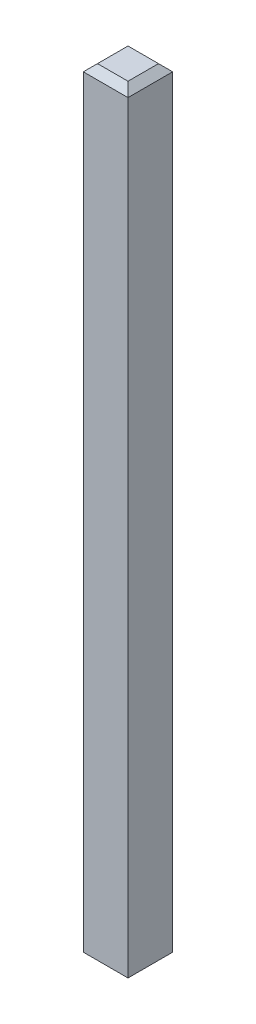
ISO-10303-21;
HEADER;
FILE_DESCRIPTION(('STEP AP214'),'2;1');
FILE_NAME('part.step','',(''),(''),'','','');
FILE_SCHEMA(('AUTOMOTIVE_DESIGN { 1 0 10303 214 1 1 1 1 }'));
ENDSEC;
DATA;
#1=APPLICATION_CONTEXT('core data for automotive mechanical design processes');
#2=APPLICATION_PROTOCOL_DEFINITION('international standard','automotive_design',2000,#1);
#3=PRODUCT_CONTEXT('',#1,'mechanical');
#4=PRODUCT('Part','Part','',(#3));
#5=PRODUCT_RELATED_PRODUCT_CATEGORY('part','',(#4));
#6=PRODUCT_DEFINITION_FORMATION('','',#4);
#7=PRODUCT_DEFINITION_CONTEXT('part definition',#1,'design');
#8=PRODUCT_DEFINITION('design','',#6,#7);
#9=PRODUCT_DEFINITION_SHAPE('','',#8);
#10=(LENGTH_UNIT() NAMED_UNIT(*) SI_UNIT(.MILLI.,.METRE.));
#11=(NAMED_UNIT(*) PLANE_ANGLE_UNIT() SI_UNIT($,.RADIAN.));
#12=(NAMED_UNIT(*) SI_UNIT($,.STERADIAN.) SOLID_ANGLE_UNIT());
#13=UNCERTAINTY_MEASURE_WITH_UNIT(LENGTH_MEASURE(1.E-05),#10,'distance_accuracy_value','');
#14=(GEOMETRIC_REPRESENTATION_CONTEXT(3) GLOBAL_UNCERTAINTY_ASSIGNED_CONTEXT((#13)) GLOBAL_UNIT_ASSIGNED_CONTEXT((#10,
#11,#12)) REPRESENTATION_CONTEXT('',''));
#15=CARTESIAN_POINT('',(0.,0.,0.));
#16=DIRECTION('',(0.,0.,1.));
#17=DIRECTION('',(1.,0.,0.));
#18=AXIS2_PLACEMENT_3D('',#15,#16,#17);
#19=CARTESIAN_POINT('',(0.315,10.95,-0.315));
#20=DIRECTION('',(-1.,0.,0.));
#21=DIRECTION('',(0.,0.,1.));
#22=AXIS2_PLACEMENT_3D('',#19,#20,#21);
#23=PLANE('',#22);
#24=DIRECTION('',(0.,-1.,0.));
#25=VECTOR('',#24,1.);
#26=CARTESIAN_POINT('',(0.315,10.95,0.315));
#27=LINE('',#26,#25);
#28=CARTESIAN_POINT('',(0.315,10.85,0.315));
#29=VERTEX_POINT('',#28);
#30=CARTESIAN_POINT('',(0.315,0.100000000000001,0.315));
#31=VERTEX_POINT('',#30);
#32=EDGE_CURVE('E151',#29,#31,#27,.T.);
#33=ORIENTED_EDGE('',*,*,#32,.T.);
#34=DIRECTION('',(0.,0.,-1.));
#35=VECTOR('',#34,1.);
#36=CARTESIAN_POINT('',(0.315,0.100000000000001,-0.315));
#37=LINE('',#36,#35);
#38=CARTESIAN_POINT('',(0.315,0.100000000000001,-0.315));
#39=VERTEX_POINT('',#38);
#40=EDGE_CURVE('E160',#31,#39,#37,.T.);
#41=ORIENTED_EDGE('',*,*,#40,.T.);
#42=DIRECTION('',(0.,-1.,0.));
#43=VECTOR('',#42,1.);
#44=CARTESIAN_POINT('',(0.315,10.95,-0.315));
#45=LINE('',#44,#43);
#46=CARTESIAN_POINT('',(0.315,10.85,-0.315));
#47=VERTEX_POINT('',#46);
#48=EDGE_CURVE('E129',#47,#39,#45,.T.);
#49=ORIENTED_EDGE('',*,*,#48,.F.);
#50=DIRECTION('',(0.,0.,1.));
#51=VECTOR('',#50,1.);
#52=CARTESIAN_POINT('',(0.315,10.85,0.315));
#53=LINE('',#52,#51);
#54=EDGE_CURVE('E162',#47,#29,#53,.T.);
#55=ORIENTED_EDGE('',*,*,#54,.T.);
#56=EDGE_LOOP('',(#33,#41,#49,#55));
#57=FACE_BOUND('',#56,.T.);
#58=ADVANCED_FACE('F41',(#57),#23,.F.);
#59=CARTESIAN_POINT('',(-0.315,10.95,-0.315));
#60=DIRECTION('',(0.,0.,1.));
#61=DIRECTION('',(1.,0.,0.));
#62=AXIS2_PLACEMENT_3D('',#59,#60,#61);
#63=PLANE('',#62);
#64=ORIENTED_EDGE('',*,*,#48,.T.);
#65=DIRECTION('',(-1.,0.,0.));
#66=VECTOR('',#65,1.);
#67=CARTESIAN_POINT('',(-0.315,0.100000000000001,-0.315));
#68=LINE('',#67,#66);
#69=CARTESIAN_POINT('',(-0.315,0.100000000000001,-0.315));
#70=VERTEX_POINT('',#69);
#71=EDGE_CURVE('E128',#39,#70,#68,.T.);
#72=ORIENTED_EDGE('',*,*,#71,.T.);
#73=DIRECTION('',(0.,-1.,0.));
#74=VECTOR('',#73,1.);
#75=CARTESIAN_POINT('',(-0.315,10.95,-0.315));
#76=LINE('',#75,#74);
#77=CARTESIAN_POINT('',(-0.315,10.85,-0.315));
#78=VERTEX_POINT('',#77);
#79=EDGE_CURVE('E111',#78,#70,#76,.T.);
#80=ORIENTED_EDGE('',*,*,#79,.F.);
#81=DIRECTION('',(1.,0.,0.));
#82=VECTOR('',#81,1.);
#83=CARTESIAN_POINT('',(0.315,10.85,-0.315));
#84=LINE('',#83,#82);
#85=EDGE_CURVE('E125',#78,#47,#84,.T.);
#86=ORIENTED_EDGE('',*,*,#85,.T.);
#87=EDGE_LOOP('',(#64,#72,#80,#86));
#88=FACE_BOUND('',#87,.T.);
#89=ADVANCED_FACE('F124',(#88),#63,.F.);
#90=CARTESIAN_POINT('',(-0.315,10.95,-0.315));
#91=DIRECTION('',(1.,0.,0.));
#92=DIRECTION('',(0.,0.,-1.));
#93=AXIS2_PLACEMENT_3D('',#90,#91,#92);
#94=PLANE('',#93);
#95=ORIENTED_EDGE('',*,*,#79,.T.);
#96=DIRECTION('',(0.,0.,1.));
#97=VECTOR('',#96,1.);
#98=CARTESIAN_POINT('',(-0.315,0.100000000000001,-0.315));
#99=LINE('',#98,#97);
#100=CARTESIAN_POINT('',(-0.315,0.100000000000001,0.315));
#101=VERTEX_POINT('',#100);
#102=EDGE_CURVE('E117',#70,#101,#99,.T.);
#103=ORIENTED_EDGE('',*,*,#102,.T.);
#104=DIRECTION('',(0.,-1.,0.));
#105=VECTOR('',#104,1.);
#106=CARTESIAN_POINT('',(-0.315,10.95,0.315));
#107=LINE('',#106,#105);
#108=CARTESIAN_POINT('',(-0.315,10.85,0.315));
#109=VERTEX_POINT('',#108);
#110=EDGE_CURVE('E113',#109,#101,#107,.T.);
#111=ORIENTED_EDGE('',*,*,#110,.F.);
#112=DIRECTION('',(0.,0.,-1.));
#113=VECTOR('',#112,1.);
#114=CARTESIAN_POINT('',(-0.315,10.85,-0.315));
#115=LINE('',#114,#113);
#116=EDGE_CURVE('E108',#109,#78,#115,.T.);
#117=ORIENTED_EDGE('',*,*,#116,.T.);
#118=EDGE_LOOP('',(#95,#103,#111,#117));
#119=FACE_BOUND('',#118,.T.);
#120=ADVANCED_FACE('F110',(#119),#94,.F.);
#121=CARTESIAN_POINT('',(-0.315,10.95,0.315));
#122=DIRECTION('',(0.,0.,-1.));
#123=DIRECTION('',(-1.,0.,0.));
#124=AXIS2_PLACEMENT_3D('',#121,#122,#123);
#125=PLANE('',#124);
#126=ORIENTED_EDGE('',*,*,#110,.T.);
#127=DIRECTION('',(1.,0.,0.));
#128=VECTOR('',#127,1.);
#129=CARTESIAN_POINT('',(-0.315,0.100000000000001,0.315));
#130=LINE('',#129,#128);
#131=EDGE_CURVE('E164',#101,#31,#130,.T.);
#132=ORIENTED_EDGE('',*,*,#131,.T.);
#133=ORIENTED_EDGE('',*,*,#32,.F.);
#134=DIRECTION('',(-1.,0.,0.));
#135=VECTOR('',#134,1.);
#136=CARTESIAN_POINT('',(-0.315,10.85,0.315));
#137=LINE('',#136,#135);
#138=EDGE_CURVE('E166',#29,#109,#137,.T.);
#139=ORIENTED_EDGE('',*,*,#138,.T.);
#140=EDGE_LOOP('',(#126,#132,#133,#139));
#141=FACE_BOUND('',#140,.T.);
#142=ADVANCED_FACE('F204',(#141),#125,.F.);
#143=CARTESIAN_POINT('',(0.,10.95,0.));
#144=DIRECTION('',(0.,1.,0.));
#145=DIRECTION('',(0.,0.,1.));
#146=AXIS2_PLACEMENT_3D('',#143,#144,#145);
#147=PLANE('',#146);
#148=DIRECTION('',(0.,0.,1.));
#149=VECTOR('',#148,1.);
#150=CARTESIAN_POINT('',(-0.215,10.95,0.315));
#151=LINE('',#150,#149);
#152=CARTESIAN_POINT('',(-0.215,10.95,-0.215));
#153=VERTEX_POINT('',#152);
#154=CARTESIAN_POINT('',(-0.215,10.95,0.215));
#155=VERTEX_POINT('',#154);
#156=EDGE_CURVE('E51',#153,#155,#151,.T.);
#157=ORIENTED_EDGE('',*,*,#156,.T.);
#158=DIRECTION('',(1.,0.,0.));
#159=VECTOR('',#158,1.);
#160=CARTESIAN_POINT('',(0.315,10.95,0.215));
#161=LINE('',#160,#159);
#162=CARTESIAN_POINT('',(0.215,10.95,0.215));
#163=VERTEX_POINT('',#162);
#164=EDGE_CURVE('E11',#155,#163,#161,.T.);
#165=ORIENTED_EDGE('',*,*,#164,.T.);
#166=DIRECTION('',(0.,0.,-1.));
#167=VECTOR('',#166,1.);
#168=CARTESIAN_POINT('',(0.215,10.95,-0.315));
#169=LINE('',#168,#167);
#170=CARTESIAN_POINT('',(0.215,10.95,-0.215));
#171=VERTEX_POINT('',#170);
#172=EDGE_CURVE('E158',#163,#171,#169,.T.);
#173=ORIENTED_EDGE('',*,*,#172,.T.);
#174=DIRECTION('',(-1.,0.,0.));
#175=VECTOR('',#174,1.);
#176=CARTESIAN_POINT('',(-0.315,10.95,-0.215));
#177=LINE('',#176,#175);
#178=EDGE_CURVE('E62',#171,#153,#177,.T.);
#179=ORIENTED_EDGE('',*,*,#178,.T.);
#180=EDGE_LOOP('',(#157,#165,#173,#179));
#181=FACE_BOUND('',#180,.T.);
#182=ADVANCED_FACE('F210',(#181),#147,.T.);
#183=CARTESIAN_POINT('',(0.,0.,0.));
#184=DIRECTION('',(0.,1.,0.));
#185=DIRECTION('',(0.,0.,1.));
#186=AXIS2_PLACEMENT_3D('',#183,#184,#185);
#187=PLANE('',#186);
#188=DIRECTION('',(0.,0.,-1.));
#189=VECTOR('',#188,1.);
#190=CARTESIAN_POINT('',(-0.215000000000001,0.,0.));
#191=LINE('',#190,#189);
#192=CARTESIAN_POINT('',(-0.215,0.,0.215000000000001));
#193=VERTEX_POINT('',#192);
#194=CARTESIAN_POINT('',(-0.215000000000001,0.,-0.215000000000001));
#195=VERTEX_POINT('',#194);
#196=EDGE_CURVE('E171',#193,#195,#191,.T.);
#197=ORIENTED_EDGE('',*,*,#196,.T.);
#198=DIRECTION('',(1.,0.,0.));
#199=VECTOR('',#198,1.);
#200=CARTESIAN_POINT('',(0.,0.,-0.215000000000001));
#201=LINE('',#200,#199);
#202=CARTESIAN_POINT('',(0.215000000000001,0.,-0.215000000000001));
#203=VERTEX_POINT('',#202);
#204=EDGE_CURVE('E118',#195,#203,#201,.T.);
#205=ORIENTED_EDGE('',*,*,#204,.T.);
#206=DIRECTION('',(0.,0.,1.));
#207=VECTOR('',#206,1.);
#208=CARTESIAN_POINT('',(0.215000000000001,0.,0.));
#209=LINE('',#208,#207);
#210=CARTESIAN_POINT('',(0.215000000000001,0.,0.215000000000001));
#211=VERTEX_POINT('',#210);
#212=EDGE_CURVE('E175',#203,#211,#209,.T.);
#213=ORIENTED_EDGE('',*,*,#212,.T.);
#214=DIRECTION('',(-1.,0.,0.));
#215=VECTOR('',#214,1.);
#216=CARTESIAN_POINT('',(0.,0.,0.215000000000001));
#217=LINE('',#216,#215);
#218=EDGE_CURVE('E173',#211,#193,#217,.T.);
#219=ORIENTED_EDGE('',*,*,#218,.T.);
#220=EDGE_LOOP('',(#197,#205,#213,#219));
#221=FACE_BOUND('',#220,.T.);
#222=ADVANCED_FACE('F212',(#221),#187,.F.);
#223=CARTESIAN_POINT('',(-0.315,0.100000000000001,0.315));
#224=DIRECTION('',(0.,0.707106781186541,-0.707106781186554));
#225=DIRECTION('',(1.,0.,0.));
#226=AXIS2_PLACEMENT_3D('',#223,#224,#225);
#227=PLANE('',#226);
#228=DIRECTION('',(0.577350269189622,-0.577350269189632,-0.577350269189622));
#229=VECTOR('',#228,1.);
#230=CARTESIAN_POINT('',(-0.315,0.100000000000001,0.315));
#231=LINE('',#230,#229);
#232=EDGE_CURVE('E152',#193,#101,#231,.F.);
#233=ORIENTED_EDGE('',*,*,#232,.F.);
#234=ORIENTED_EDGE('',*,*,#218,.F.);
#235=DIRECTION('',(-0.577350269189622,-0.577350269189632,-0.577350269189622));
#236=VECTOR('',#235,1.);
#237=CARTESIAN_POINT('',(0.105000000000003,-0.11,0.105000000000002));
#238=LINE('',#237,#236);
#239=EDGE_CURVE('E148',#31,#211,#238,.T.);
#240=ORIENTED_EDGE('',*,*,#239,.F.);
#241=ORIENTED_EDGE('',*,*,#131,.F.);
#242=EDGE_LOOP('',(#233,#234,#240,#241));
#243=FACE_BOUND('',#242,.T.);
#244=ADVANCED_FACE('F191',(#243),#227,.F.);
#245=CARTESIAN_POINT('',(0.315,0.100000000000001,-0.315));
#246=DIRECTION('',(-0.707106781186554,0.707106781186541,0.));
#247=DIRECTION('',(0.,0.,-1.));
#248=AXIS2_PLACEMENT_3D('',#245,#246,#247);
#249=PLANE('',#248);
#250=ORIENTED_EDGE('',*,*,#239,.T.);
#251=ORIENTED_EDGE('',*,*,#212,.F.);
#252=DIRECTION('',(0.577350269189622,0.577350269189632,-0.577350269189622));
#253=VECTOR('',#252,1.);
#254=CARTESIAN_POINT('',(0.315,0.100000000000001,-0.315));
#255=LINE('',#254,#253);
#256=EDGE_CURVE('E139',#39,#203,#255,.F.);
#257=ORIENTED_EDGE('',*,*,#256,.F.);
#258=ORIENTED_EDGE('',*,*,#40,.F.);
#259=EDGE_LOOP('',(#250,#251,#257,#258));
#260=FACE_BOUND('',#259,.T.);
#261=ADVANCED_FACE('F195',(#260),#249,.F.);
#262=CARTESIAN_POINT('',(-0.315,0.100000000000001,-0.315));
#263=DIRECTION('',(0.707106781186554,0.707106781186541,0.));
#264=DIRECTION('',(0.,0.,1.));
#265=AXIS2_PLACEMENT_3D('',#262,#263,#264);
#266=PLANE('',#265);
#267=ORIENTED_EDGE('',*,*,#232,.T.);
#268=ORIENTED_EDGE('',*,*,#102,.F.);
#269=DIRECTION('',(0.577350269189622,-0.577350269189632,0.577350269189622));
#270=VECTOR('',#269,1.);
#271=CARTESIAN_POINT('',(-0.315,0.100000000000001,-0.315));
#272=LINE('',#271,#270);
#273=EDGE_CURVE('E138',#195,#70,#272,.F.);
#274=ORIENTED_EDGE('',*,*,#273,.F.);
#275=ORIENTED_EDGE('',*,*,#196,.F.);
#276=EDGE_LOOP('',(#267,#268,#274,#275));
#277=FACE_BOUND('',#276,.T.);
#278=ADVANCED_FACE('F203',(#277),#266,.F.);
#279=CARTESIAN_POINT('',(-0.315,0.100000000000001,-0.315));
#280=DIRECTION('',(0.,0.707106781186541,0.707106781186554));
#281=DIRECTION('',(-1.,0.,0.));
#282=AXIS2_PLACEMENT_3D('',#279,#280,#281);
#283=PLANE('',#282);
#284=ORIENTED_EDGE('',*,*,#256,.T.);
#285=ORIENTED_EDGE('',*,*,#204,.F.);
#286=ORIENTED_EDGE('',*,*,#273,.T.);
#287=ORIENTED_EDGE('',*,*,#71,.F.);
#288=EDGE_LOOP('',(#284,#285,#286,#287));
#289=FACE_BOUND('',#288,.T.);
#290=ADVANCED_FACE('F198',(#289),#283,.F.);
#291=CARTESIAN_POINT('',(0.,10.95,-0.215));
#292=DIRECTION('',(0.,0.707106781186544,-0.707106781186551));
#293=DIRECTION('',(1.,0.,0.));
#294=AXIS2_PLACEMENT_3D('',#291,#292,#293);
#295=PLANE('',#294);
#296=DIRECTION('',(-0.577350269189624,0.577350269189629,0.577350269189624));
#297=VECTOR('',#296,1.);
#298=CARTESIAN_POINT('',(0.143333333333334,11.0216666666667,-0.143333333333334));
#299=LINE('',#298,#297);
#300=EDGE_CURVE('E134',#47,#171,#299,.T.);
#301=ORIENTED_EDGE('',*,*,#300,.F.);
#302=ORIENTED_EDGE('',*,*,#85,.F.);
#303=DIRECTION('',(0.577350269189624,0.577350269189629,0.577350269189624));
#304=VECTOR('',#303,1.);
#305=CARTESIAN_POINT('',(-0.143333333333334,11.0216666666667,-0.143333333333334));
#306=LINE('',#305,#304);
#307=EDGE_CURVE('E46',#153,#78,#306,.F.);
#308=ORIENTED_EDGE('',*,*,#307,.F.);
#309=ORIENTED_EDGE('',*,*,#178,.F.);
#310=EDGE_LOOP('',(#301,#302,#308,#309));
#311=FACE_BOUND('',#310,.T.);
#312=ADVANCED_FACE('F44',(#311),#295,.T.);
#313=CARTESIAN_POINT('',(-0.215,10.95,0.));
#314=DIRECTION('',(-0.707106781186551,0.707106781186544,0.));
#315=DIRECTION('',(0.,0.,-1.));
#316=AXIS2_PLACEMENT_3D('',#313,#314,#315);
#317=PLANE('',#316);
#318=ORIENTED_EDGE('',*,*,#307,.T.);
#319=ORIENTED_EDGE('',*,*,#116,.F.);
#320=DIRECTION('',(0.577350269189624,0.577350269189629,-0.577350269189624));
#321=VECTOR('',#320,1.);
#322=CARTESIAN_POINT('',(-0.143333333333333,11.0216666666667,0.143333333333334));
#323=LINE('',#322,#321);
#324=EDGE_CURVE('E141',#155,#109,#323,.F.);
#325=ORIENTED_EDGE('',*,*,#324,.F.);
#326=ORIENTED_EDGE('',*,*,#156,.F.);
#327=EDGE_LOOP('',(#318,#319,#325,#326));
#328=FACE_BOUND('',#327,.T.);
#329=ADVANCED_FACE('F137',(#328),#317,.T.);
#330=CARTESIAN_POINT('',(0.215,10.95,0.));
#331=DIRECTION('',(0.707106781186551,0.707106781186544,0.));
#332=DIRECTION('',(0.,0.,1.));
#333=AXIS2_PLACEMENT_3D('',#330,#331,#332);
#334=PLANE('',#333);
#335=ORIENTED_EDGE('',*,*,#300,.T.);
#336=ORIENTED_EDGE('',*,*,#172,.F.);
#337=DIRECTION('',(0.577350269189624,-0.577350269189629,0.577350269189624));
#338=VECTOR('',#337,1.);
#339=CARTESIAN_POINT('',(0.143333333333334,11.0216666666667,0.143333333333334));
#340=LINE('',#339,#338);
#341=EDGE_CURVE('E144',#29,#163,#340,.F.);
#342=ORIENTED_EDGE('',*,*,#341,.F.);
#343=ORIENTED_EDGE('',*,*,#54,.F.);
#344=EDGE_LOOP('',(#335,#336,#342,#343));
#345=FACE_BOUND('',#344,.T.);
#346=ADVANCED_FACE('F209',(#345),#334,.T.);
#347=CARTESIAN_POINT('',(0.,10.95,0.215));
#348=DIRECTION('',(0.,0.707106781186544,0.707106781186551));
#349=DIRECTION('',(-1.,0.,0.));
#350=AXIS2_PLACEMENT_3D('',#347,#348,#349);
#351=PLANE('',#350);
#352=ORIENTED_EDGE('',*,*,#324,.T.);
#353=ORIENTED_EDGE('',*,*,#138,.F.);
#354=ORIENTED_EDGE('',*,*,#341,.T.);
#355=ORIENTED_EDGE('',*,*,#164,.F.);
#356=EDGE_LOOP('',(#352,#353,#354,#355));
#357=FACE_BOUND('',#356,.T.);
#358=ADVANCED_FACE('F207',(#357),#351,.T.);
#359=CLOSED_SHELL('',(#58,#89,#120,#142,#182,#222,#244,#261,#278,#290,#312,#329,#346,#358));
#360=MANIFOLD_SOLID_BREP('B2',#359);
#361=ADVANCED_BREP_SHAPE_REPRESENTATION('',(#18,#360),#14);
#362=SHAPE_DEFINITION_REPRESENTATION(#9,#361);
ENDSEC;
END-ISO-10303-21;
